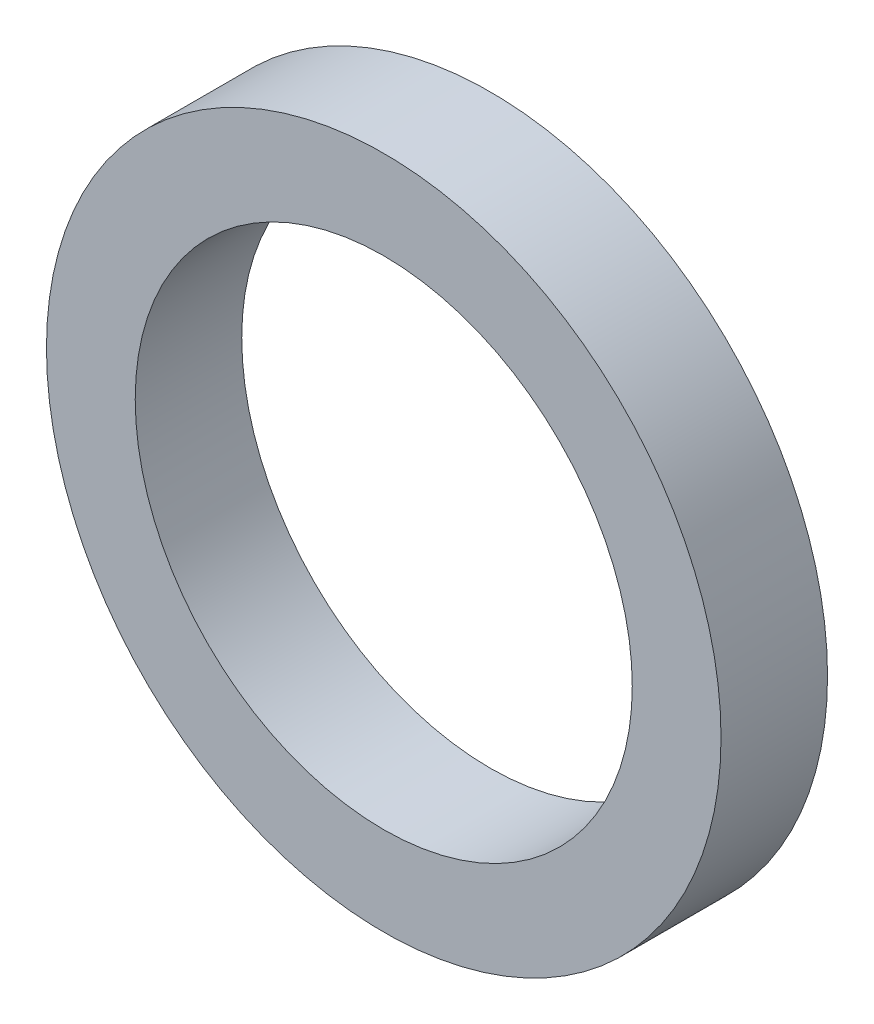
ISO-10303-21;
HEADER;
FILE_DESCRIPTION(('STEP AP214'),'2;1');
FILE_NAME('part.step','',(''),(''),'','','');
FILE_SCHEMA(('AUTOMOTIVE_DESIGN { 1 0 10303 214 1 1 1 1 }'));
ENDSEC;
DATA;
#1=APPLICATION_CONTEXT('core data for automotive mechanical design processes');
#2=APPLICATION_PROTOCOL_DEFINITION('international standard','automotive_design',2000,#1);
#3=PRODUCT_CONTEXT('',#1,'mechanical');
#4=PRODUCT('Part','Part','',(#3));
#5=PRODUCT_RELATED_PRODUCT_CATEGORY('part','',(#4));
#6=PRODUCT_DEFINITION_FORMATION('','',#4);
#7=PRODUCT_DEFINITION_CONTEXT('part definition',#1,'design');
#8=PRODUCT_DEFINITION('design','',#6,#7);
#9=PRODUCT_DEFINITION_SHAPE('','',#8);
#10=(LENGTH_UNIT() NAMED_UNIT(*) SI_UNIT(.MILLI.,.METRE.));
#11=(NAMED_UNIT(*) PLANE_ANGLE_UNIT() SI_UNIT($,.RADIAN.));
#12=(NAMED_UNIT(*) SI_UNIT($,.STERADIAN.) SOLID_ANGLE_UNIT());
#13=UNCERTAINTY_MEASURE_WITH_UNIT(LENGTH_MEASURE(1.E-05),#10,'distance_accuracy_value','');
#14=(GEOMETRIC_REPRESENTATION_CONTEXT(3) GLOBAL_UNCERTAINTY_ASSIGNED_CONTEXT((#13)) GLOBAL_UNIT_ASSIGNED_CONTEXT((#10,
#11,#12)) REPRESENTATION_CONTEXT('',''));
#15=CARTESIAN_POINT('',(0.,0.,0.));
#16=DIRECTION('',(0.,0.,1.));
#17=DIRECTION('',(1.,0.,0.));
#18=AXIS2_PLACEMENT_3D('',#15,#16,#17);
#19=CARTESIAN_POINT('',(0.,0.,3.));
#20=DIRECTION('',(0.,0.,1.));
#21=DIRECTION('',(1.,0.,0.));
#22=AXIS2_PLACEMENT_3D('',#19,#20,#21);
#23=PLANE('',#22);
#24=CARTESIAN_POINT('',(0.,0.,3.));
#25=DIRECTION('',(0.,0.,1.));
#26=DIRECTION('',(1.,0.,0.));
#27=AXIS2_PLACEMENT_3D('',#24,#25,#26);
#28=CIRCLE('',#27,9.5);
#29=CARTESIAN_POINT('',(9.5,0.,3.));
#30=VERTEX_POINT('',#29);
#31=EDGE_CURVE('E10',#30,#30,#28,.T.);
#32=ORIENTED_EDGE('',*,*,#31,.T.);
#33=EDGE_LOOP('',(#32));
#34=FACE_BOUND('',#33,.T.);
#35=CARTESIAN_POINT('',(0.,0.,3.));
#36=DIRECTION('',(0.,0.,1.));
#37=DIRECTION('',(1.,0.,0.));
#38=AXIS2_PLACEMENT_3D('',#35,#36,#37);
#39=CIRCLE('',#38,7.);
#40=CARTESIAN_POINT('',(7.,0.,3.));
#41=VERTEX_POINT('',#40);
#42=EDGE_CURVE('E42',#41,#41,#39,.T.);
#43=ORIENTED_EDGE('',*,*,#42,.F.);
#44=EDGE_LOOP('',(#43));
#45=FACE_BOUND('',#44,.T.);
#46=ADVANCED_FACE('F31',(#34,#45),#23,.T.);
#47=CARTESIAN_POINT('',(0.,0.,0.));
#48=DIRECTION('',(0.,0.,1.));
#49=DIRECTION('',(1.,0.,0.));
#50=AXIS2_PLACEMENT_3D('',#47,#48,#49);
#51=PLANE('',#50);
#52=CARTESIAN_POINT('',(0.,0.,0.));
#53=DIRECTION('',(0.,0.,1.));
#54=DIRECTION('',(1.,0.,0.));
#55=AXIS2_PLACEMENT_3D('',#52,#53,#54);
#56=CIRCLE('',#55,9.5);
#57=CARTESIAN_POINT('',(9.5,0.,0.));
#58=VERTEX_POINT('',#57);
#59=EDGE_CURVE('E35',#58,#58,#56,.T.);
#60=ORIENTED_EDGE('',*,*,#59,.F.);
#61=EDGE_LOOP('',(#60));
#62=FACE_BOUND('',#61,.T.);
#63=CARTESIAN_POINT('',(0.,0.,0.));
#64=DIRECTION('',(0.,0.,1.));
#65=DIRECTION('',(1.,0.,0.));
#66=AXIS2_PLACEMENT_3D('',#63,#64,#65);
#67=CIRCLE('',#66,7.);
#68=CARTESIAN_POINT('',(7.,0.,0.));
#69=VERTEX_POINT('',#68);
#70=EDGE_CURVE('E44',#69,#69,#67,.T.);
#71=ORIENTED_EDGE('',*,*,#70,.T.);
#72=EDGE_LOOP('',(#71));
#73=FACE_BOUND('',#72,.T.);
#74=ADVANCED_FACE('F54',(#62,#73),#51,.F.);
#75=CARTESIAN_POINT('',(0.,0.,3.));
#76=DIRECTION('',(0.,0.,-1.));
#77=DIRECTION('',(-1.,0.,0.));
#78=AXIS2_PLACEMENT_3D('',#75,#76,#77);
#79=CYLINDRICAL_SURFACE('',#78,9.5);
#80=ORIENTED_EDGE('',*,*,#31,.F.);
#81=EDGE_LOOP('',(#80));
#82=FACE_BOUND('',#81,.T.);
#83=ORIENTED_EDGE('',*,*,#59,.T.);
#84=EDGE_LOOP('',(#83));
#85=FACE_BOUND('',#84,.T.);
#86=ADVANCED_FACE('F33',(#82,#85),#79,.T.);
#87=CARTESIAN_POINT('',(0.,0.,3.));
#88=DIRECTION('',(0.,0.,-1.));
#89=DIRECTION('',(-1.,0.,0.));
#90=AXIS2_PLACEMENT_3D('',#87,#88,#89);
#91=CYLINDRICAL_SURFACE('',#90,7.);
#92=ORIENTED_EDGE('',*,*,#42,.T.);
#93=EDGE_LOOP('',(#92));
#94=FACE_BOUND('',#93,.T.);
#95=ORIENTED_EDGE('',*,*,#70,.F.);
#96=EDGE_LOOP('',(#95));
#97=FACE_BOUND('',#96,.T.);
#98=ADVANCED_FACE('F50',(#94,#97),#91,.F.);
#99=CLOSED_SHELL('',(#46,#74,#86,#98));
#100=MANIFOLD_SOLID_BREP('B2',#99);
#101=ADVANCED_BREP_SHAPE_REPRESENTATION('',(#18,#100),#14);
#102=SHAPE_DEFINITION_REPRESENTATION(#9,#101);
ENDSEC;
END-ISO-10303-21;
